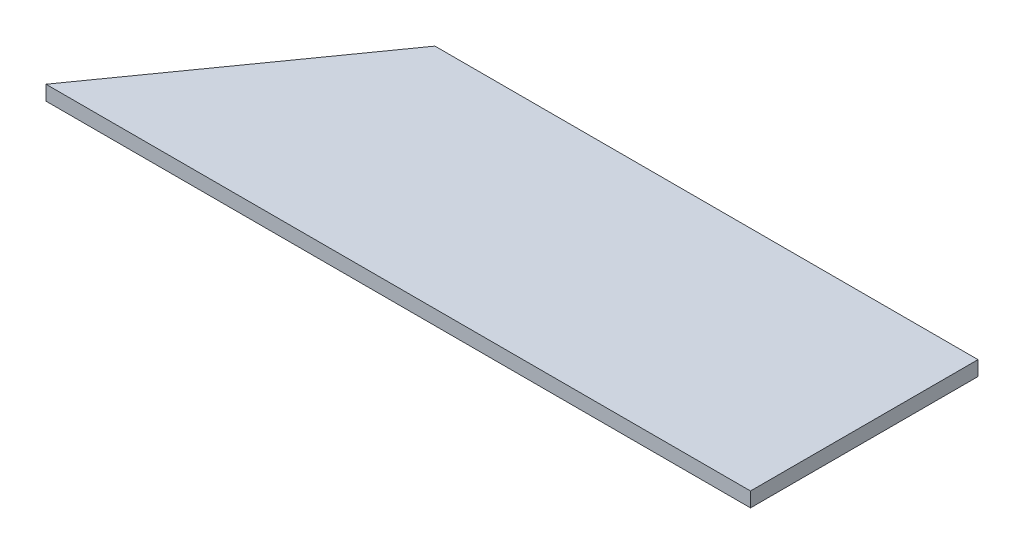
ISO-10303-21;
HEADER;
FILE_DESCRIPTION(('STEP AP214'),'2;1');
FILE_NAME('part.step','',(''),(''),'','','');
FILE_SCHEMA(('AUTOMOTIVE_DESIGN { 1 0 10303 214 1 1 1 1 }'));
ENDSEC;
DATA;
#1=APPLICATION_CONTEXT('core data for automotive mechanical design processes');
#2=APPLICATION_PROTOCOL_DEFINITION('international standard','automotive_design',2000,#1);
#3=PRODUCT_CONTEXT('',#1,'mechanical');
#4=PRODUCT('Part','Part','',(#3));
#5=PRODUCT_RELATED_PRODUCT_CATEGORY('part','',(#4));
#6=PRODUCT_DEFINITION_FORMATION('','',#4);
#7=PRODUCT_DEFINITION_CONTEXT('part definition',#1,'design');
#8=PRODUCT_DEFINITION('design','',#6,#7);
#9=PRODUCT_DEFINITION_SHAPE('','',#8);
#10=(LENGTH_UNIT() NAMED_UNIT(*) SI_UNIT(.MILLI.,.METRE.));
#11=(NAMED_UNIT(*) PLANE_ANGLE_UNIT() SI_UNIT($,.RADIAN.));
#12=(NAMED_UNIT(*) SI_UNIT($,.STERADIAN.) SOLID_ANGLE_UNIT());
#13=UNCERTAINTY_MEASURE_WITH_UNIT(LENGTH_MEASURE(1.E-05),#10,'distance_accuracy_value','');
#14=(GEOMETRIC_REPRESENTATION_CONTEXT(3) GLOBAL_UNCERTAINTY_ASSIGNED_CONTEXT((#13)) GLOBAL_UNIT_ASSIGNED_CONTEXT((#10,
#11,#12)) REPRESENTATION_CONTEXT('',''));
#15=CARTESIAN_POINT('',(0.,0.,0.));
#16=DIRECTION('',(0.,0.,1.));
#17=DIRECTION('',(1.,0.,0.));
#18=AXIS2_PLACEMENT_3D('',#15,#16,#17);
#19=CARTESIAN_POINT('',(69.85,6.35,-98.425));
#20=DIRECTION('',(0.815507144735217,0.,0.578747005941122));
#21=DIRECTION('',(0.578747005941122,0.,-0.815507144735217));
#22=AXIS2_PLACEMENT_3D('',#19,#20,#21);
#23=PLANE('',#22);
#24=DIRECTION('',(-0.578747005941122,0.,0.815507144735217));
#25=VECTOR('',#24,1.);
#26=CARTESIAN_POINT('',(69.85,0.,-98.425));
#27=LINE('',#26,#25);
#28=CARTESIAN_POINT('',(69.85,0.,-98.425));
#29=VERTEX_POINT('',#28);
#30=CARTESIAN_POINT('',(0.,0.,0.));
#31=VERTEX_POINT('',#30);
#32=EDGE_CURVE('E97',#29,#31,#27,.T.);
#33=ORIENTED_EDGE('',*,*,#32,.T.);
#34=DIRECTION('',(0.,-1.,0.));
#35=VECTOR('',#34,1.);
#36=CARTESIAN_POINT('',(0.,6.35,0.));
#37=LINE('',#36,#35);
#38=CARTESIAN_POINT('',(0.,6.35,0.));
#39=VERTEX_POINT('',#38);
#40=EDGE_CURVE('E11',#39,#31,#37,.T.);
#41=ORIENTED_EDGE('',*,*,#40,.F.);
#42=DIRECTION('',(-0.578747005941122,0.,0.815507144735217));
#43=VECTOR('',#42,1.);
#44=CARTESIAN_POINT('',(69.85,6.35,-98.425));
#45=LINE('',#44,#43);
#46=CARTESIAN_POINT('',(69.85,6.35,-98.425));
#47=VERTEX_POINT('',#46);
#48=EDGE_CURVE('E85',#47,#39,#45,.T.);
#49=ORIENTED_EDGE('',*,*,#48,.F.);
#50=DIRECTION('',(0.,-1.,0.));
#51=VECTOR('',#50,1.);
#52=CARTESIAN_POINT('',(69.85,6.35,-98.425));
#53=LINE('',#52,#51);
#54=EDGE_CURVE('E93',#47,#29,#53,.T.);
#55=ORIENTED_EDGE('',*,*,#54,.T.);
#56=EDGE_LOOP('',(#33,#41,#49,#55));
#57=FACE_BOUND('',#56,.T.);
#58=ADVANCED_FACE('F34',(#57),#23,.F.);
#59=CARTESIAN_POINT('',(0.,6.35,0.));
#60=DIRECTION('',(0.,0.,-1.));
#61=DIRECTION('',(-1.,0.,0.));
#62=AXIS2_PLACEMENT_3D('',#59,#60,#61);
#63=PLANE('',#62);
#64=DIRECTION('',(1.,0.,0.));
#65=VECTOR('',#64,1.);
#66=CARTESIAN_POINT('',(0.,0.,0.));
#67=LINE('',#66,#65);
#68=CARTESIAN_POINT('',(304.8,0.,0.));
#69=VERTEX_POINT('',#68);
#70=EDGE_CURVE('E89',#31,#69,#67,.T.);
#71=ORIENTED_EDGE('',*,*,#70,.T.);
#72=DIRECTION('',(0.,-1.,0.));
#73=VECTOR('',#72,1.);
#74=CARTESIAN_POINT('',(304.8,6.35,0.));
#75=LINE('',#74,#73);
#76=CARTESIAN_POINT('',(304.8,6.35,0.));
#77=VERTEX_POINT('',#76);
#78=EDGE_CURVE('E42',#77,#69,#75,.T.);
#79=ORIENTED_EDGE('',*,*,#78,.F.);
#80=DIRECTION('',(1.,0.,0.));
#81=VECTOR('',#80,1.);
#82=CARTESIAN_POINT('',(0.,6.35,0.));
#83=LINE('',#82,#81);
#84=EDGE_CURVE('E80',#39,#77,#83,.T.);
#85=ORIENTED_EDGE('',*,*,#84,.F.);
#86=ORIENTED_EDGE('',*,*,#40,.T.);
#87=EDGE_LOOP('',(#71,#79,#85,#86));
#88=FACE_BOUND('',#87,.T.);
#89=ADVANCED_FACE('F88',(#88),#63,.F.);
#90=CARTESIAN_POINT('',(304.8,6.35,0.));
#91=DIRECTION('',(-1.,0.,0.));
#92=DIRECTION('',(0.,0.,1.));
#93=AXIS2_PLACEMENT_3D('',#90,#91,#92);
#94=PLANE('',#93);
#95=DIRECTION('',(0.,0.,-1.));
#96=VECTOR('',#95,1.);
#97=CARTESIAN_POINT('',(304.8,0.,0.));
#98=LINE('',#97,#96);
#99=CARTESIAN_POINT('',(304.8,0.,-98.425));
#100=VERTEX_POINT('',#99);
#101=EDGE_CURVE('E67',#69,#100,#98,.T.);
#102=ORIENTED_EDGE('',*,*,#101,.T.);
#103=DIRECTION('',(0.,-1.,0.));
#104=VECTOR('',#103,1.);
#105=CARTESIAN_POINT('',(304.8,6.35,-98.425));
#106=LINE('',#105,#104);
#107=CARTESIAN_POINT('',(304.8,6.35,-98.425));
#108=VERTEX_POINT('',#107);
#109=EDGE_CURVE('E90',#108,#100,#106,.T.);
#110=ORIENTED_EDGE('',*,*,#109,.F.);
#111=DIRECTION('',(0.,0.,-1.));
#112=VECTOR('',#111,1.);
#113=CARTESIAN_POINT('',(304.8,6.35,0.));
#114=LINE('',#113,#112);
#115=EDGE_CURVE('E83',#77,#108,#114,.T.);
#116=ORIENTED_EDGE('',*,*,#115,.F.);
#117=ORIENTED_EDGE('',*,*,#78,.T.);
#118=EDGE_LOOP('',(#102,#110,#116,#117));
#119=FACE_BOUND('',#118,.T.);
#120=ADVANCED_FACE('F91',(#119),#94,.F.);
#121=CARTESIAN_POINT('',(304.8,6.35,-98.425));
#122=DIRECTION('',(0.,0.,1.));
#123=DIRECTION('',(1.,0.,0.));
#124=AXIS2_PLACEMENT_3D('',#121,#122,#123);
#125=PLANE('',#124);
#126=DIRECTION('',(-1.,0.,0.));
#127=VECTOR('',#126,1.);
#128=CARTESIAN_POINT('',(304.8,0.,-98.425));
#129=LINE('',#128,#127);
#130=EDGE_CURVE('E73',#100,#29,#129,.T.);
#131=ORIENTED_EDGE('',*,*,#130,.T.);
#132=ORIENTED_EDGE('',*,*,#54,.F.);
#133=DIRECTION('',(-1.,0.,0.));
#134=VECTOR('',#133,1.);
#135=CARTESIAN_POINT('',(304.8,6.35,-98.425));
#136=LINE('',#135,#134);
#137=EDGE_CURVE('E50',#108,#47,#136,.T.);
#138=ORIENTED_EDGE('',*,*,#137,.F.);
#139=ORIENTED_EDGE('',*,*,#109,.T.);
#140=EDGE_LOOP('',(#131,#132,#138,#139));
#141=FACE_BOUND('',#140,.T.);
#142=ADVANCED_FACE('F104',(#141),#125,.F.);
#143=CARTESIAN_POINT('',(0.,6.35,0.));
#144=DIRECTION('',(0.,1.,0.));
#145=DIRECTION('',(0.,0.,1.));
#146=AXIS2_PLACEMENT_3D('',#143,#144,#145);
#147=PLANE('',#146);
#148=ORIENTED_EDGE('',*,*,#48,.T.);
#149=ORIENTED_EDGE('',*,*,#84,.T.);
#150=ORIENTED_EDGE('',*,*,#115,.T.);
#151=ORIENTED_EDGE('',*,*,#137,.T.);
#152=EDGE_LOOP('',(#148,#149,#150,#151));
#153=FACE_BOUND('',#152,.T.);
#154=ADVANCED_FACE('F81',(#153),#147,.T.);
#155=CARTESIAN_POINT('',(0.,0.,0.));
#156=DIRECTION('',(0.,1.,0.));
#157=DIRECTION('',(0.,0.,1.));
#158=AXIS2_PLACEMENT_3D('',#155,#156,#157);
#159=PLANE('',#158);
#160=ORIENTED_EDGE('',*,*,#32,.F.);
#161=ORIENTED_EDGE('',*,*,#130,.F.);
#162=ORIENTED_EDGE('',*,*,#101,.F.);
#163=ORIENTED_EDGE('',*,*,#70,.F.);
#164=EDGE_LOOP('',(#160,#161,#162,#163));
#165=FACE_BOUND('',#164,.T.);
#166=ADVANCED_FACE('F107',(#165),#159,.F.);
#167=CLOSED_SHELL('',(#58,#89,#120,#142,#154,#166));
#168=MANIFOLD_SOLID_BREP('B2',#167);
#169=ADVANCED_BREP_SHAPE_REPRESENTATION('',(#18,#168),#14);
#170=SHAPE_DEFINITION_REPRESENTATION(#9,#169);
ENDSEC;
END-ISO-10303-21;
